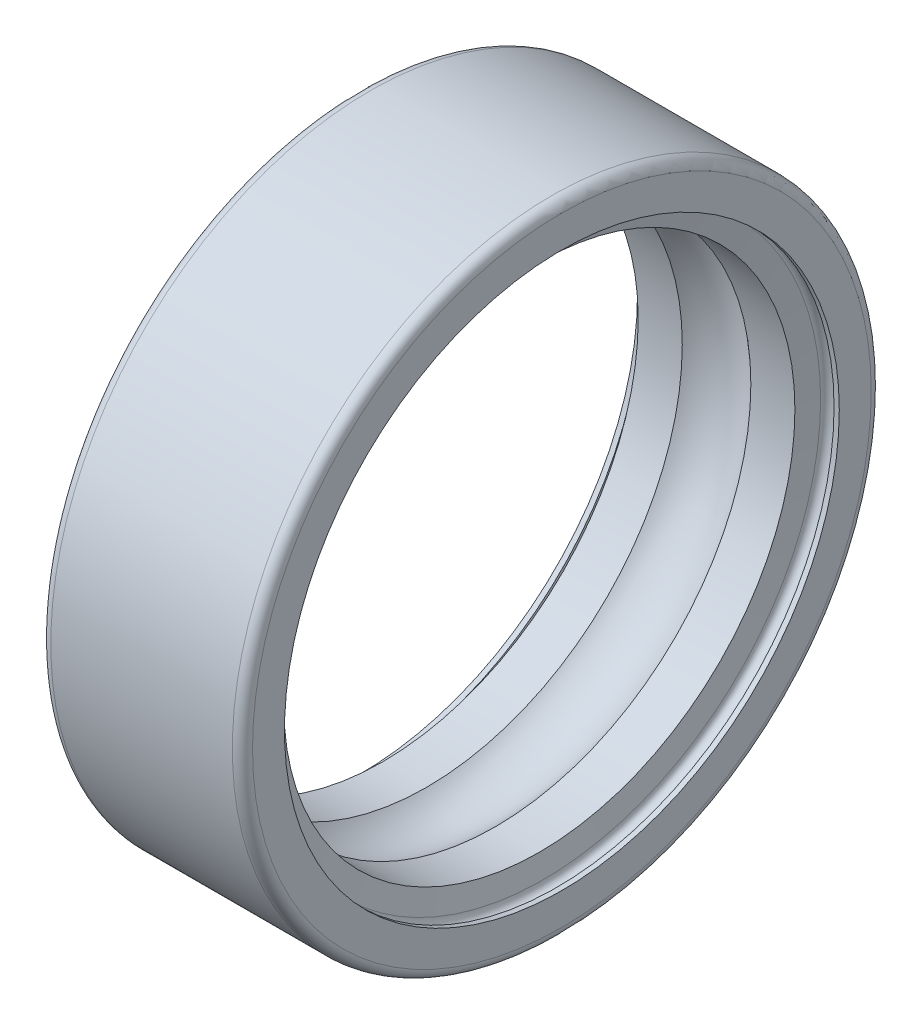
ISO-10303-21;
HEADER;
FILE_DESCRIPTION(('STEP AP214'),'2;1');
FILE_NAME('part.step','',(''),(''),'','','');
FILE_SCHEMA(('AUTOMOTIVE_DESIGN { 1 0 10303 214 1 1 1 1 }'));
ENDSEC;
DATA;
#1=APPLICATION_CONTEXT('core data for automotive mechanical design processes');
#2=APPLICATION_PROTOCOL_DEFINITION('international standard','automotive_design',2000,#1);
#3=PRODUCT_CONTEXT('',#1,'mechanical');
#4=PRODUCT('Part','Part','',(#3));
#5=PRODUCT_RELATED_PRODUCT_CATEGORY('part','',(#4));
#6=PRODUCT_DEFINITION_FORMATION('','',#4);
#7=PRODUCT_DEFINITION_CONTEXT('part definition',#1,'design');
#8=PRODUCT_DEFINITION('design','',#6,#7);
#9=PRODUCT_DEFINITION_SHAPE('','',#8);
#10=(LENGTH_UNIT() NAMED_UNIT(*) SI_UNIT(.MILLI.,.METRE.));
#11=(NAMED_UNIT(*) PLANE_ANGLE_UNIT() SI_UNIT($,.RADIAN.));
#12=(NAMED_UNIT(*) SI_UNIT($,.STERADIAN.) SOLID_ANGLE_UNIT());
#13=UNCERTAINTY_MEASURE_WITH_UNIT(LENGTH_MEASURE(1.E-05),#10,'distance_accuracy_value','');
#14=(GEOMETRIC_REPRESENTATION_CONTEXT(3) GLOBAL_UNCERTAINTY_ASSIGNED_CONTEXT((#13)) GLOBAL_UNIT_ASSIGNED_CONTEXT((#10,
#11,#12)) REPRESENTATION_CONTEXT('',''));
#15=CARTESIAN_POINT('',(0.,0.,0.));
#16=DIRECTION('',(0.,0.,1.));
#17=DIRECTION('',(1.,0.,0.));
#18=AXIS2_PLACEMENT_3D('',#15,#16,#17);
#19=CARTESIAN_POINT('',(0.299999999999938,0.,0.));
#20=DIRECTION('',(1.,0.,0.));
#21=DIRECTION('',(0.,0.,-1.));
#22=AXIS2_PLACEMENT_3D('',#19,#20,#21);
#23=TOROIDAL_SURFACE('',#22,9.20000000000006,0.299999999999938);
#24=CARTESIAN_POINT('',(0.,0.,0.));
#25=DIRECTION('',(1.,0.,0.));
#26=DIRECTION('',(0.,0.,-1.));
#27=AXIS2_PLACEMENT_3D('',#24,#25,#26);
#28=CIRCLE('',#27,9.2);
#29=CARTESIAN_POINT('',(0.,0.,-9.2));
#30=VERTEX_POINT('',#29);
#31=EDGE_CURVE('E10',#30,#30,#28,.T.);
#32=ORIENTED_EDGE('',*,*,#31,.T.);
#33=EDGE_LOOP('',(#32));
#34=FACE_BOUND('',#33,.T.);
#35=CARTESIAN_POINT('',(0.3,0.,0.));
#36=DIRECTION('',(1.,0.,0.));
#37=DIRECTION('',(0.,0.,-1.));
#38=AXIS2_PLACEMENT_3D('',#35,#36,#37);
#39=CIRCLE('',#38,9.5);
#40=CARTESIAN_POINT('',(0.3,0.,-9.5));
#41=VERTEX_POINT('',#40);
#42=EDGE_CURVE('E75',#41,#41,#39,.T.);
#43=ORIENTED_EDGE('',*,*,#42,.F.);
#44=EDGE_LOOP('',(#43));
#45=FACE_BOUND('',#44,.T.);
#46=ADVANCED_FACE('F29',(#34,#45),#23,.T.);
#47=CARTESIAN_POINT('',(0.,9.2,0.));
#48=DIRECTION('',(-1.,0.,0.));
#49=DIRECTION('',(0.,0.,1.));
#50=AXIS2_PLACEMENT_3D('',#47,#48,#49);
#51=PLANE('',#50);
#52=CARTESIAN_POINT('',(0.,0.,0.));
#53=DIRECTION('',(1.,0.,0.));
#54=DIRECTION('',(0.,0.,-1.));
#55=AXIS2_PLACEMENT_3D('',#52,#53,#54);
#56=CIRCLE('',#55,8.25);
#57=CARTESIAN_POINT('',(0.,0.,-8.25));
#58=VERTEX_POINT('',#57);
#59=EDGE_CURVE('E35',#58,#58,#56,.T.);
#60=ORIENTED_EDGE('',*,*,#59,.T.);
#61=EDGE_LOOP('',(#60));
#62=FACE_BOUND('',#61,.T.);
#63=ORIENTED_EDGE('',*,*,#31,.F.);
#64=EDGE_LOOP('',(#63));
#65=FACE_BOUND('',#64,.T.);
#66=ADVANCED_FACE('F83',(#62,#65),#51,.T.);
#67=CARTESIAN_POINT('',(5.7,0.,0.));
#68=DIRECTION('',(1.,0.,0.));
#69=DIRECTION('',(0.,0.,-1.));
#70=AXIS2_PLACEMENT_3D('',#67,#68,#69);
#71=CYLINDRICAL_SURFACE('',#70,8.25);
#72=CARTESIAN_POINT('',(0.15555555555556,0.,0.));
#73=DIRECTION('',(1.,0.,0.));
#74=DIRECTION('',(0.,0.,-1.));
#75=AXIS2_PLACEMENT_3D('',#72,#73,#74);
#76=CIRCLE('',#75,8.25);
#77=CARTESIAN_POINT('',(0.15555555555556,0.,-8.25));
#78=VERTEX_POINT('',#77);
#79=EDGE_CURVE('E39',#78,#78,#76,.T.);
#80=ORIENTED_EDGE('',*,*,#79,.T.);
#81=EDGE_LOOP('',(#80));
#82=FACE_BOUND('',#81,.T.);
#83=ORIENTED_EDGE('',*,*,#59,.F.);
#84=EDGE_LOOP('',(#83));
#85=FACE_BOUND('',#84,.T.);
#86=ADVANCED_FACE('F87',(#82,#85),#71,.F.);
#87=CARTESIAN_POINT('',(0.35555555555556,0.,0.));
#88=DIRECTION('',(1.,0.,0.));
#89=DIRECTION('',(0.,0.,-1.));
#90=AXIS2_PLACEMENT_3D('',#87,#88,#89);
#91=TOROIDAL_SURFACE('',#90,8.25,0.2);
#92=CARTESIAN_POINT('',(0.55555555555556,0.,0.));
#93=DIRECTION('',(1.,0.,0.));
#94=DIRECTION('',(0.,0.,-1.));
#95=AXIS2_PLACEMENT_3D('',#92,#93,#94);
#96=CIRCLE('',#95,8.25);
#97=CARTESIAN_POINT('',(0.55555555555556,0.,-8.25));
#98=VERTEX_POINT('',#97);
#99=EDGE_CURVE('E43',#98,#98,#96,.T.);
#100=ORIENTED_EDGE('',*,*,#99,.T.);
#101=EDGE_LOOP('',(#100));
#102=FACE_BOUND('',#101,.T.);
#103=ORIENTED_EDGE('',*,*,#79,.F.);
#104=EDGE_LOOP('',(#103));
#105=FACE_BOUND('',#104,.T.);
#106=ADVANCED_FACE('F91',(#102,#105),#91,.F.);
#107=CARTESIAN_POINT('',(0.55555555555556,0.,0.));
#108=DIRECTION('',(-1.,0.,0.));
#109=DIRECTION('',(0.,0.,1.));
#110=AXIS2_PLACEMENT_3D('',#107,#108,#109);
#111=CONICAL_SURFACE('',#110,8.25,1.39626340159547);
#112=CARTESIAN_POINT('',(0.67016809301606,0.,0.));
#113=DIRECTION('',(1.,0.,0.));
#114=DIRECTION('',(0.,0.,-1.));
#115=AXIS2_PLACEMENT_3D('',#112,#113,#114);
#116=CIRCLE('',#115,7.6);
#117=CARTESIAN_POINT('',(0.67016809301606,0.,-7.6));
#118=VERTEX_POINT('',#117);
#119=EDGE_CURVE('E48',#118,#118,#116,.T.);
#120=ORIENTED_EDGE('',*,*,#119,.T.);
#121=EDGE_LOOP('',(#120));
#122=FACE_BOUND('',#121,.T.);
#123=ORIENTED_EDGE('',*,*,#99,.F.);
#124=EDGE_LOOP('',(#123));
#125=FACE_BOUND('',#124,.T.);
#126=ADVANCED_FACE('F98',(#122,#125),#111,.F.);
#127=CARTESIAN_POINT('',(5.7,0.,0.));
#128=DIRECTION('',(1.,0.,0.));
#129=DIRECTION('',(0.,0.,-1.));
#130=AXIS2_PLACEMENT_3D('',#127,#128,#129);
#131=CYLINDRICAL_SURFACE('',#130,7.6);
#132=CARTESIAN_POINT('',(1.9801960972814,0.,0.));
#133=DIRECTION('',(1.,0.,0.));
#134=DIRECTION('',(0.,0.,-1.));
#135=AXIS2_PLACEMENT_3D('',#132,#133,#134);
#136=CIRCLE('',#135,7.6);
#137=CARTESIAN_POINT('',(1.9801960972814,0.,-7.6));
#138=VERTEX_POINT('',#137);
#139=EDGE_CURVE('E51',#138,#138,#136,.T.);
#140=ORIENTED_EDGE('',*,*,#139,.T.);
#141=EDGE_LOOP('',(#140));
#142=FACE_BOUND('',#141,.T.);
#143=ORIENTED_EDGE('',*,*,#119,.F.);
#144=EDGE_LOOP('',(#143));
#145=FACE_BOUND('',#144,.T.);
#146=ADVANCED_FACE('F102',(#142,#145),#131,.F.);
#147=CARTESIAN_POINT('',(3.,0.,0.));
#148=DIRECTION('',(1.,0.,0.));
#149=DIRECTION('',(0.,0.,-1.));
#150=AXIS2_PLACEMENT_3D('',#147,#148,#149);
#151=TOROIDAL_SURFACE('',#150,6.49999999999989,1.50000000000011);
#152=CARTESIAN_POINT('',(4.0198039027186,0.,0.));
#153=DIRECTION('',(1.,0.,0.));
#154=DIRECTION('',(0.,0.,-1.));
#155=AXIS2_PLACEMENT_3D('',#152,#153,#154);
#156=CIRCLE('',#155,7.6);
#157=CARTESIAN_POINT('',(4.0198039027186,0.,-7.6));
#158=VERTEX_POINT('',#157);
#159=EDGE_CURVE('E54',#158,#158,#156,.T.);
#160=ORIENTED_EDGE('',*,*,#159,.T.);
#161=EDGE_LOOP('',(#160));
#162=FACE_BOUND('',#161,.T.);
#163=ORIENTED_EDGE('',*,*,#139,.F.);
#164=EDGE_LOOP('',(#163));
#165=FACE_BOUND('',#164,.T.);
#166=ADVANCED_FACE('F106',(#162,#165),#151,.F.);
#167=CARTESIAN_POINT('',(5.7,0.,0.));
#168=DIRECTION('',(1.,0.,0.));
#169=DIRECTION('',(0.,0.,-1.));
#170=AXIS2_PLACEMENT_3D('',#167,#168,#169);
#171=CYLINDRICAL_SURFACE('',#170,7.6);
#172=CARTESIAN_POINT('',(5.3298319069839,0.,0.));
#173=DIRECTION('',(1.,0.,0.));
#174=DIRECTION('',(0.,0.,-1.));
#175=AXIS2_PLACEMENT_3D('',#172,#173,#174);
#176=CIRCLE('',#175,7.6);
#177=CARTESIAN_POINT('',(5.3298319069839,0.,-7.6));
#178=VERTEX_POINT('',#177);
#179=EDGE_CURVE('E57',#178,#178,#176,.T.);
#180=ORIENTED_EDGE('',*,*,#179,.T.);
#181=EDGE_LOOP('',(#180));
#182=FACE_BOUND('',#181,.T.);
#183=ORIENTED_EDGE('',*,*,#159,.F.);
#184=EDGE_LOOP('',(#183));
#185=FACE_BOUND('',#184,.T.);
#186=ADVANCED_FACE('F110',(#182,#185),#171,.F.);
#187=CARTESIAN_POINT('',(5.3298319069839,0.,0.));
#188=DIRECTION('',(1.,0.,0.));
#189=DIRECTION('',(0.,0.,-1.));
#190=AXIS2_PLACEMENT_3D('',#187,#188,#189);
#191=CONICAL_SURFACE('',#190,7.6,1.39626340159547);
#192=CARTESIAN_POINT('',(5.4444444444444,0.,0.));
#193=DIRECTION('',(1.,0.,0.));
#194=DIRECTION('',(0.,0.,-1.));
#195=AXIS2_PLACEMENT_3D('',#192,#193,#194);
#196=CIRCLE('',#195,8.25);
#197=CARTESIAN_POINT('',(5.4444444444444,0.,-8.25));
#198=VERTEX_POINT('',#197);
#199=EDGE_CURVE('E60',#198,#198,#196,.T.);
#200=ORIENTED_EDGE('',*,*,#199,.T.);
#201=EDGE_LOOP('',(#200));
#202=FACE_BOUND('',#201,.T.);
#203=ORIENTED_EDGE('',*,*,#179,.F.);
#204=EDGE_LOOP('',(#203));
#205=FACE_BOUND('',#204,.T.);
#206=ADVANCED_FACE('F114',(#202,#205),#191,.F.);
#207=CARTESIAN_POINT('',(5.6444444444444,0.,0.));
#208=DIRECTION('',(1.,0.,0.));
#209=DIRECTION('',(0.,0.,-1.));
#210=AXIS2_PLACEMENT_3D('',#207,#208,#209);
#211=TOROIDAL_SURFACE('',#210,8.25,0.2);
#212=CARTESIAN_POINT('',(5.8444444444444,0.,0.));
#213=DIRECTION('',(1.,0.,0.));
#214=DIRECTION('',(0.,0.,-1.));
#215=AXIS2_PLACEMENT_3D('',#212,#213,#214);
#216=CIRCLE('',#215,8.25);
#217=CARTESIAN_POINT('',(5.8444444444444,0.,-8.25));
#218=VERTEX_POINT('',#217);
#219=EDGE_CURVE('E63',#218,#218,#216,.T.);
#220=ORIENTED_EDGE('',*,*,#219,.T.);
#221=EDGE_LOOP('',(#220));
#222=FACE_BOUND('',#221,.T.);
#223=ORIENTED_EDGE('',*,*,#199,.F.);
#224=EDGE_LOOP('',(#223));
#225=FACE_BOUND('',#224,.T.);
#226=ADVANCED_FACE('F118',(#222,#225),#211,.F.);
#227=CARTESIAN_POINT('',(5.7,0.,0.));
#228=DIRECTION('',(1.,0.,0.));
#229=DIRECTION('',(0.,0.,-1.));
#230=AXIS2_PLACEMENT_3D('',#227,#228,#229);
#231=CYLINDRICAL_SURFACE('',#230,8.25);
#232=CARTESIAN_POINT('',(6.,0.,0.));
#233=DIRECTION('',(1.,0.,0.));
#234=DIRECTION('',(0.,0.,-1.));
#235=AXIS2_PLACEMENT_3D('',#232,#233,#234);
#236=CIRCLE('',#235,8.25);
#237=CARTESIAN_POINT('',(6.,0.,-8.25));
#238=VERTEX_POINT('',#237);
#239=EDGE_CURVE('E66',#238,#238,#236,.T.);
#240=ORIENTED_EDGE('',*,*,#239,.T.);
#241=EDGE_LOOP('',(#240));
#242=FACE_BOUND('',#241,.T.);
#243=ORIENTED_EDGE('',*,*,#219,.F.);
#244=EDGE_LOOP('',(#243));
#245=FACE_BOUND('',#244,.T.);
#246=ADVANCED_FACE('F122',(#242,#245),#231,.F.);
#247=CARTESIAN_POINT('',(6.,8.25,0.));
#248=DIRECTION('',(1.,0.,0.));
#249=DIRECTION('',(0.,0.,-1.));
#250=AXIS2_PLACEMENT_3D('',#247,#248,#249);
#251=PLANE('',#250);
#252=CARTESIAN_POINT('',(6.,0.,0.));
#253=DIRECTION('',(1.,0.,0.));
#254=DIRECTION('',(0.,0.,-1.));
#255=AXIS2_PLACEMENT_3D('',#252,#253,#254);
#256=CIRCLE('',#255,9.2);
#257=CARTESIAN_POINT('',(6.,0.,-9.2));
#258=VERTEX_POINT('',#257);
#259=EDGE_CURVE('E69',#258,#258,#256,.T.);
#260=ORIENTED_EDGE('',*,*,#259,.T.);
#261=EDGE_LOOP('',(#260));
#262=FACE_BOUND('',#261,.T.);
#263=ORIENTED_EDGE('',*,*,#239,.F.);
#264=EDGE_LOOP('',(#263));
#265=FACE_BOUND('',#264,.T.);
#266=ADVANCED_FACE('F126',(#262,#265),#251,.T.);
#267=CARTESIAN_POINT('',(5.70000000000012,0.,0.));
#268=DIRECTION('',(1.,0.,0.));
#269=DIRECTION('',(0.,0.,-1.));
#270=AXIS2_PLACEMENT_3D('',#267,#268,#269);
#271=TOROIDAL_SURFACE('',#270,9.20000000000012,0.299999999999877);
#272=CARTESIAN_POINT('',(5.7,0.,0.));
#273=DIRECTION('',(1.,0.,0.));
#274=DIRECTION('',(0.,0.,-1.));
#275=AXIS2_PLACEMENT_3D('',#272,#273,#274);
#276=CIRCLE('',#275,9.5);
#277=CARTESIAN_POINT('',(5.7,0.,-9.5));
#278=VERTEX_POINT('',#277);
#279=EDGE_CURVE('E72',#278,#278,#276,.T.);
#280=ORIENTED_EDGE('',*,*,#279,.T.);
#281=EDGE_LOOP('',(#280));
#282=FACE_BOUND('',#281,.T.);
#283=ORIENTED_EDGE('',*,*,#259,.F.);
#284=EDGE_LOOP('',(#283));
#285=FACE_BOUND('',#284,.T.);
#286=ADVANCED_FACE('F130',(#282,#285),#271,.T.);
#287=CARTESIAN_POINT('',(5.7,0.,0.));
#288=DIRECTION('',(1.,0.,0.));
#289=DIRECTION('',(0.,0.,-1.));
#290=AXIS2_PLACEMENT_3D('',#287,#288,#289);
#291=CYLINDRICAL_SURFACE('',#290,9.5);
#292=ORIENTED_EDGE('',*,*,#42,.T.);
#293=EDGE_LOOP('',(#292));
#294=FACE_BOUND('',#293,.T.);
#295=ORIENTED_EDGE('',*,*,#279,.F.);
#296=EDGE_LOOP('',(#295));
#297=FACE_BOUND('',#296,.T.);
#298=ADVANCED_FACE('F79',(#294,#297),#291,.T.);
#299=CLOSED_SHELL('',(#46,#66,#86,#106,#126,#146,#166,#186,#206,#226,#246,#266,#286,#298));
#300=MANIFOLD_SOLID_BREP('B2',#299);
#301=ADVANCED_BREP_SHAPE_REPRESENTATION('',(#18,#300),#14);
#302=SHAPE_DEFINITION_REPRESENTATION(#9,#301);
ENDSEC;
END-ISO-10303-21;
